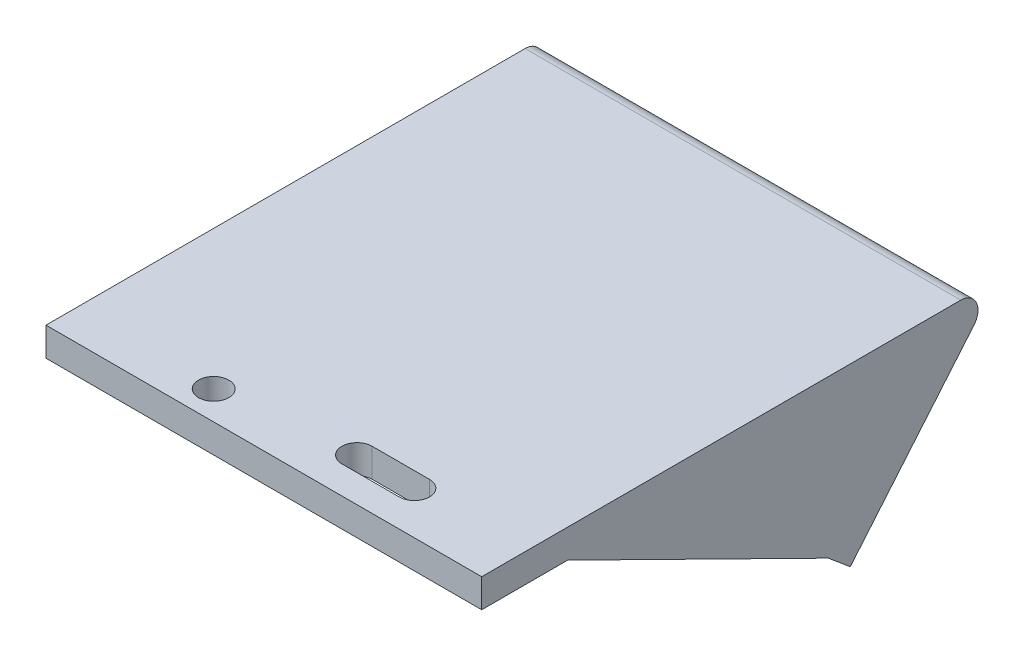
ISO-10303-21;
HEADER;
FILE_DESCRIPTION(('STEP AP214'),'2;1');
FILE_NAME('part.step','',(''),(''),'','','');
FILE_SCHEMA(('AUTOMOTIVE_DESIGN { 1 0 10303 214 1 1 1 1 }'));
ENDSEC;
DATA;
#1=APPLICATION_CONTEXT('core data for automotive mechanical design processes');
#2=APPLICATION_PROTOCOL_DEFINITION('international standard','automotive_design',2000,#1);
#3=PRODUCT_CONTEXT('',#1,'mechanical');
#4=PRODUCT('Part','Part','',(#3));
#5=PRODUCT_RELATED_PRODUCT_CATEGORY('part','',(#4));
#6=PRODUCT_DEFINITION_FORMATION('','',#4);
#7=PRODUCT_DEFINITION_CONTEXT('part definition',#1,'design');
#8=PRODUCT_DEFINITION('design','',#6,#7);
#9=PRODUCT_DEFINITION_SHAPE('','',#8);
#10=(LENGTH_UNIT() NAMED_UNIT(*) SI_UNIT(.MILLI.,.METRE.));
#11=(NAMED_UNIT(*) PLANE_ANGLE_UNIT() SI_UNIT($,.RADIAN.));
#12=(NAMED_UNIT(*) SI_UNIT($,.STERADIAN.) SOLID_ANGLE_UNIT());
#13=UNCERTAINTY_MEASURE_WITH_UNIT(LENGTH_MEASURE(1.E-05),#10,'distance_accuracy_value','');
#14=(GEOMETRIC_REPRESENTATION_CONTEXT(3) GLOBAL_UNCERTAINTY_ASSIGNED_CONTEXT((#13)) GLOBAL_UNIT_ASSIGNED_CONTEXT((#10,
#11,#12)) REPRESENTATION_CONTEXT('',''));
#15=CARTESIAN_POINT('',(0.,0.,0.));
#16=DIRECTION('',(0.,0.,1.));
#17=DIRECTION('',(1.,0.,0.));
#18=AXIS2_PLACEMENT_3D('',#15,#16,#17);
#19=CARTESIAN_POINT('',(76.,0.,0.));
#20=DIRECTION('',(0.,0.,-1.));
#21=DIRECTION('',(0.,1.,0.));
#22=AXIS2_PLACEMENT_3D('',#19,#20,#21);
#23=PLANE('',#22);
#24=DIRECTION('',(1.,0.,0.));
#25=VECTOR('',#24,1.);
#26=CARTESIAN_POINT('',(76.,0.,0.));
#27=LINE('',#26,#25);
#28=CARTESIAN_POINT('',(73.,0.,0.));
#29=VERTEX_POINT('',#28);
#30=CARTESIAN_POINT('',(149.,0.,0.));
#31=VERTEX_POINT('',#30);
#32=EDGE_CURVE('E251',#29,#31,#27,.T.);
#33=ORIENTED_EDGE('',*,*,#32,.F.);
#34=DIRECTION('',(0.,1.,0.));
#35=VECTOR('',#34,1.);
#36=CARTESIAN_POINT('',(73.,0.,0.));
#37=LINE('',#36,#35);
#38=CARTESIAN_POINT('',(73.,-5.,0.));
#39=VERTEX_POINT('',#38);
#40=EDGE_CURVE('E182',#39,#29,#37,.T.);
#41=ORIENTED_EDGE('',*,*,#40,.F.);
#42=DIRECTION('',(1.,0.,0.));
#43=VECTOR('',#42,1.);
#44=CARTESIAN_POINT('',(76.,-5.,0.));
#45=LINE('',#44,#43);
#46=CARTESIAN_POINT('',(149.,-5.,0.));
#47=VERTEX_POINT('',#46);
#48=EDGE_CURVE('E266',#39,#47,#45,.T.);
#49=ORIENTED_EDGE('',*,*,#48,.T.);
#50=DIRECTION('',(0.,1.,0.));
#51=VECTOR('',#50,1.);
#52=CARTESIAN_POINT('',(149.,0.,0.));
#53=LINE('',#52,#51);
#54=EDGE_CURVE('E207',#47,#31,#53,.T.);
#55=ORIENTED_EDGE('',*,*,#54,.T.);
#56=EDGE_LOOP('',(#33,#41,#49,#55));
#57=FACE_BOUND('',#56,.T.);
#58=ADVANCED_FACE('F39',(#57),#23,.F.);
#59=CARTESIAN_POINT('',(76.,-5.,0.));
#60=DIRECTION('',(0.,1.,0.));
#61=DIRECTION('',(0.,0.,1.));
#62=AXIS2_PLACEMENT_3D('',#59,#60,#61);
#63=PLANE('',#62);
#64=DIRECTION('',(1.,0.,0.));
#65=VECTOR('',#64,1.);
#66=CARTESIAN_POINT('',(76.,-5.,-10.15));
#67=LINE('',#66,#65);
#68=CARTESIAN_POINT('',(119.75,-5.,-10.15));
#69=VERTEX_POINT('',#68);
#70=CARTESIAN_POINT('',(129.75,-5.,-10.15));
#71=VERTEX_POINT('',#70);
#72=EDGE_CURVE('E176',#69,#71,#67,.T.);
#73=ORIENTED_EDGE('',*,*,#72,.F.);
#74=CARTESIAN_POINT('',(119.75,-5.,-7.5));
#75=DIRECTION('',(0.,-1.,0.));
#76=DIRECTION('',(0.,0.,1.));
#77=AXIS2_PLACEMENT_3D('',#74,#75,#76);
#78=CIRCLE('',#77,2.65);
#79=CARTESIAN_POINT('',(119.75,-5.,-4.85));
#80=VERTEX_POINT('',#79);
#81=EDGE_CURVE('E174',#80,#69,#78,.T.);
#82=ORIENTED_EDGE('',*,*,#81,.F.);
#83=DIRECTION('',(-1.,0.,0.));
#84=VECTOR('',#83,1.);
#85=CARTESIAN_POINT('',(76.,-5.,-4.85000000000001));
#86=LINE('',#85,#84);
#87=CARTESIAN_POINT('',(129.75,-5.,-4.85));
#88=VERTEX_POINT('',#87);
#89=EDGE_CURVE('E150',#88,#80,#86,.T.);
#90=ORIENTED_EDGE('',*,*,#89,.F.);
#91=CARTESIAN_POINT('',(129.75,-5.,-7.49999999999999));
#92=DIRECTION('',(0.,-1.,0.));
#93=DIRECTION('',(0.,0.,1.));
#94=AXIS2_PLACEMENT_3D('',#91,#92,#93);
#95=CIRCLE('',#94,2.65);
#96=EDGE_CURVE('E179',#71,#88,#95,.T.);
#97=ORIENTED_EDGE('',*,*,#96,.F.);
#98=EDGE_LOOP('',(#73,#82,#90,#97));
#99=FACE_BOUND('',#98,.T.);
#100=CARTESIAN_POINT('',(97.25,-5.,-5.));
#101=DIRECTION('',(0.,-1.,0.));
#102=DIRECTION('',(0.,0.,1.));
#103=AXIS2_PLACEMENT_3D('',#100,#101,#102);
#104=CIRCLE('',#103,2.65);
#105=CARTESIAN_POINT('',(97.25,-5.,-2.35));
#106=VERTEX_POINT('',#105);
#107=EDGE_CURVE('E234',#106,#106,#104,.T.);
#108=ORIENTED_EDGE('',*,*,#107,.F.);
#109=EDGE_LOOP('',(#108));
#110=FACE_BOUND('',#109,.T.);
#111=ORIENTED_EDGE('',*,*,#48,.F.);
#112=DIRECTION('',(0.,0.,1.));
#113=VECTOR('',#112,1.);
#114=CARTESIAN_POINT('',(73.,-5.,0.));
#115=LINE('',#114,#113);
#116=CARTESIAN_POINT('',(73.,-5.,-15.));
#117=VERTEX_POINT('',#116);
#118=EDGE_CURVE('E185',#117,#39,#115,.T.);
#119=ORIENTED_EDGE('',*,*,#118,.F.);
#120=DIRECTION('',(1.,0.,0.));
#121=VECTOR('',#120,1.);
#122=CARTESIAN_POINT('',(73.,-5.,-15.));
#123=LINE('',#122,#121);
#124=CARTESIAN_POINT('',(76.,-5.,-15.));
#125=VERTEX_POINT('',#124);
#126=EDGE_CURVE('E203',#117,#125,#123,.T.);
#127=ORIENTED_EDGE('',*,*,#126,.T.);
#128=DIRECTION('',(0.,0.,-1.));
#129=VECTOR('',#128,1.);
#130=CARTESIAN_POINT('',(76.,-5.,0.));
#131=LINE('',#130,#129);
#132=CARTESIAN_POINT('',(76.,-5.,-72.8439446359236));
#133=VERTEX_POINT('',#132);
#134=EDGE_CURVE('E244',#125,#133,#131,.T.);
#135=ORIENTED_EDGE('',*,*,#134,.T.);
#136=DIRECTION('',(1.,0.,0.));
#137=VECTOR('',#136,1.);
#138=CARTESIAN_POINT('',(76.,-5.,-72.8439446359236));
#139=LINE('',#138,#137);
#140=CARTESIAN_POINT('',(146.,-5.,-72.8439446359236));
#141=VERTEX_POINT('',#140);
#142=EDGE_CURVE('E282',#141,#133,#139,.F.);
#143=ORIENTED_EDGE('',*,*,#142,.F.);
#144=DIRECTION('',(0.,0.,-1.));
#145=VECTOR('',#144,1.);
#146=CARTESIAN_POINT('',(146.,-5.,0.));
#147=LINE('',#146,#145);
#148=CARTESIAN_POINT('',(146.,-5.,-15.));
#149=VERTEX_POINT('',#148);
#150=EDGE_CURVE('E252',#149,#141,#147,.T.);
#151=ORIENTED_EDGE('',*,*,#150,.F.);
#152=DIRECTION('',(-1.,0.,0.));
#153=VECTOR('',#152,1.);
#154=CARTESIAN_POINT('',(149.,-5.,-15.));
#155=LINE('',#154,#153);
#156=CARTESIAN_POINT('',(149.,-5.,-15.));
#157=VERTEX_POINT('',#156);
#158=EDGE_CURVE('E224',#157,#149,#155,.T.);
#159=ORIENTED_EDGE('',*,*,#158,.F.);
#160=DIRECTION('',(0.,0.,1.));
#161=VECTOR('',#160,1.);
#162=CARTESIAN_POINT('',(149.,-5.,0.));
#163=LINE('',#162,#161);
#164=EDGE_CURVE('E222',#157,#47,#163,.T.);
#165=ORIENTED_EDGE('',*,*,#164,.T.);
#166=EDGE_LOOP('',(#111,#119,#127,#135,#143,#151,#159,#165));
#167=FACE_BOUND('',#166,.T.);
#168=ADVANCED_FACE('F294',(#99,#110,#167),#63,.F.);
#169=CARTESIAN_POINT('',(76.,-27.4278396763265,-60.4582733969436));
#170=DIRECTION('',(0.,-0.642787609686538,-0.766044443118979));
#171=DIRECTION('',(0.,0.766044443118979,-0.642787609686538));
#172=AXIS2_PLACEMENT_3D('',#169,#170,#171);
#173=PLANE('',#172);
#174=CARTESIAN_POINT('',(133.5,-19.7673952451367,-66.886149493809));
#175=DIRECTION('',(0.,-0.642787609686538,-0.766044443118979));
#176=DIRECTION('',(0.,-0.766044443118979,0.642787609686538));
#177=AXIS2_PLACEMENT_3D('',#174,#175,#176);
#178=CIRCLE('',#177,1.65000000000001);
#179=CARTESIAN_POINT('',(133.5,-21.031368576283,-65.8255499378262));
#180=VERTEX_POINT('',#179);
#181=EDGE_CURVE('E238',#180,#180,#178,.T.);
#182=ORIENTED_EDGE('',*,*,#181,.T.);
#183=EDGE_LOOP('',(#182));
#184=FACE_BOUND('',#183,.T.);
#185=CARTESIAN_POINT('',(88.5,-19.7673952451367,-66.886149493809));
#186=DIRECTION('',(0.,-0.642787609686538,-0.766044443118979));
#187=DIRECTION('',(0.,-0.766044443118979,0.642787609686538));
#188=AXIS2_PLACEMENT_3D('',#185,#186,#187);
#189=CIRCLE('',#188,1.65);
#190=CARTESIAN_POINT('',(88.5,-21.031368576283,-65.8255499378262));
#191=VERTEX_POINT('',#190);
#192=EDGE_CURVE('E237',#191,#191,#189,.T.);
#193=ORIENTED_EDGE('',*,*,#192,.T.);
#194=EDGE_LOOP('',(#193));
#195=FACE_BOUND('',#194,.T.);
#196=DIRECTION('',(0.,-0.766044443118979,0.642787609686538));
#197=VECTOR('',#196,1.);
#198=CARTESIAN_POINT('',(76.,-27.4278396763265,-60.4582733969436));
#199=LINE('',#198,#197);
#200=CARTESIAN_POINT('',(76.,-9.92836282905961,-75.1420779652805));
#201=VERTEX_POINT('',#200);
#202=CARTESIAN_POINT('',(76.,-27.4278396763265,-60.4582733969436));
#203=VERTEX_POINT('',#202);
#204=EDGE_CURVE('E247',#201,#203,#199,.T.);
#205=ORIENTED_EDGE('',*,*,#204,.T.);
#206=DIRECTION('',(1.,0.,0.));
#207=VECTOR('',#206,1.);
#208=CARTESIAN_POINT('',(76.,-27.4278396763265,-60.4582733969436));
#209=LINE('',#208,#207);
#210=CARTESIAN_POINT('',(146.,-27.4278396763265,-60.4582733969436));
#211=VERTEX_POINT('',#210);
#212=EDGE_CURVE('E263',#203,#211,#209,.T.);
#213=ORIENTED_EDGE('',*,*,#212,.T.);
#214=DIRECTION('',(0.,-0.766044443118979,0.642787609686538));
#215=VECTOR('',#214,1.);
#216=CARTESIAN_POINT('',(146.,-27.4278396763265,-60.4582733969436));
#217=LINE('',#216,#215);
#218=CARTESIAN_POINT('',(146.,-9.92836282905961,-75.1420779652805));
#219=VERTEX_POINT('',#218);
#220=EDGE_CURVE('E248',#219,#211,#217,.T.);
#221=ORIENTED_EDGE('',*,*,#220,.F.);
#222=DIRECTION('',(1.,0.,0.));
#223=VECTOR('',#222,1.);
#224=CARTESIAN_POINT('',(146.,-9.92836282905961,-75.1420779652805));
#225=LINE('',#224,#223);
#226=EDGE_CURVE('E279',#201,#219,#225,.T.);
#227=ORIENTED_EDGE('',*,*,#226,.F.);
#228=EDGE_LOOP('',(#205,#213,#221,#227));
#229=FACE_BOUND('',#228,.T.);
#230=ADVANCED_FACE('F302',(#184,#195,#229),#173,.F.);
#231=CARTESIAN_POINT('',(76.,-30.6417777247592,-64.2884956125385));
#232=DIRECTION('',(0.,0.766044443118979,-0.642787609686538));
#233=DIRECTION('',(0.,0.642787609686538,0.766044443118979));
#234=AXIS2_PLACEMENT_3D('',#231,#232,#233);
#235=PLANE('',#234);
#236=ORIENTED_EDGE('',*,*,#212,.F.);
#237=DIRECTION('',(1.,0.,0.));
#238=VECTOR('',#237,1.);
#239=CARTESIAN_POINT('',(73.,-27.4278396763265,-60.4582733969436));
#240=LINE('',#239,#238);
#241=CARTESIAN_POINT('',(73.,-27.4278396763265,-60.4582733969436));
#242=VERTEX_POINT('',#241);
#243=EDGE_CURVE('E199',#242,#203,#240,.T.);
#244=ORIENTED_EDGE('',*,*,#243,.F.);
#245=DIRECTION('',(0.,0.642787609686538,0.766044443118979));
#246=VECTOR('',#245,1.);
#247=CARTESIAN_POINT('',(73.,13.6745711607901,-11.4743276175264));
#248=LINE('',#247,#246);
#249=CARTESIAN_POINT('',(73.,-30.6417777247592,-64.2884956125385));
#250=VERTEX_POINT('',#249);
#251=EDGE_CURVE('E189',#250,#242,#248,.T.);
#252=ORIENTED_EDGE('',*,*,#251,.F.);
#253=DIRECTION('',(1.,0.,0.));
#254=VECTOR('',#253,1.);
#255=CARTESIAN_POINT('',(76.,-30.6417777247592,-64.2884956125385));
#256=LINE('',#255,#254);
#257=CARTESIAN_POINT('',(149.,-30.6417777247592,-64.2884956125385));
#258=VERTEX_POINT('',#257);
#259=EDGE_CURVE('E260',#250,#258,#256,.T.);
#260=ORIENTED_EDGE('',*,*,#259,.T.);
#261=DIRECTION('',(0.,0.642787609686538,0.766044443118979));
#262=VECTOR('',#261,1.);
#263=CARTESIAN_POINT('',(149.,13.6745711607901,-11.4743276175264));
#264=LINE('',#263,#262);
#265=CARTESIAN_POINT('',(149.,-27.4278396763265,-60.4582733969436));
#266=VERTEX_POINT('',#265);
#267=EDGE_CURVE('E217',#258,#266,#264,.T.);
#268=ORIENTED_EDGE('',*,*,#267,.T.);
#269=DIRECTION('',(-1.,0.,0.));
#270=VECTOR('',#269,1.);
#271=CARTESIAN_POINT('',(149.,-27.4278396763265,-60.4582733969436));
#272=LINE('',#271,#270);
#273=EDGE_CURVE('E228',#266,#211,#272,.T.);
#274=ORIENTED_EDGE('',*,*,#273,.T.);
#275=EDGE_LOOP('',(#236,#244,#252,#260,#268,#274));
#276=FACE_BOUND('',#275,.T.);
#277=ADVANCED_FACE('F306',(#276),#235,.F.);
#278=CARTESIAN_POINT('',(76.,0.,-90.));
#279=DIRECTION('',(0.,0.642787609686538,0.76604444311898));
#280=DIRECTION('',(0.,-0.76604444311898,0.642787609686538));
#281=AXIS2_PLACEMENT_3D('',#278,#279,#280);
#282=PLANE('',#281);
#283=CARTESIAN_POINT('',(133.5,-22.9813332935694,-70.7163717094039));
#284=DIRECTION('',(0.,-0.642787609686538,-0.76604444311898));
#285=DIRECTION('',(0.,-0.76604444311898,0.642787609686538));
#286=AXIS2_PLACEMENT_3D('',#283,#284,#285);
#287=CIRCLE('',#286,1.65000000000001);
#288=CARTESIAN_POINT('',(133.5,-24.2453066247157,-69.6557721534211));
#289=VERTEX_POINT('',#288);
#290=EDGE_CURVE('E255',#289,#289,#287,.T.);
#291=ORIENTED_EDGE('',*,*,#290,.F.);
#292=EDGE_LOOP('',(#291));
#293=FACE_BOUND('',#292,.T.);
#294=CARTESIAN_POINT('',(88.5,-22.9813332935694,-70.7163717094039));
#295=DIRECTION('',(0.,-0.642787609686538,-0.76604444311898));
#296=DIRECTION('',(0.,-0.76604444311898,0.642787609686538));
#297=AXIS2_PLACEMENT_3D('',#294,#295,#296);
#298=CIRCLE('',#297,1.65);
#299=CARTESIAN_POINT('',(88.5,-24.2453066247157,-69.6557721534211));
#300=VERTEX_POINT('',#299);
#301=EDGE_CURVE('E241',#300,#300,#298,.T.);
#302=ORIENTED_EDGE('',*,*,#301,.F.);
#303=EDGE_LOOP('',(#302));
#304=FACE_BOUND('',#303,.T.);
#305=ORIENTED_EDGE('',*,*,#259,.F.);
#306=DIRECTION('',(0.,-0.766044443118979,0.642787609686538));
#307=VECTOR('',#306,1.);
#308=CARTESIAN_POINT('',(73.,-44.3163488855493,-52.8141679950121));
#309=LINE('',#308,#307);
#310=CARTESIAN_POINT('',(73.,-4.92836282905962,-85.8646125678283));
#311=VERTEX_POINT('',#310);
#312=EDGE_CURVE('E192',#311,#250,#309,.T.);
#313=ORIENTED_EDGE('',*,*,#312,.F.);
#314=DIRECTION('',(1.,0.,0.));
#315=VECTOR('',#314,1.);
#316=CARTESIAN_POINT('',(76.,-4.92836282905961,-85.8646125678283));
#317=LINE('',#316,#315);
#318=CARTESIAN_POINT('',(149.,-4.92836282905962,-85.8646125678283));
#319=VERTEX_POINT('',#318);
#320=EDGE_CURVE('E276',#319,#311,#317,.F.);
#321=ORIENTED_EDGE('',*,*,#320,.F.);
#322=DIRECTION('',(0.,-0.766044443118979,0.642787609686538));
#323=VECTOR('',#322,1.);
#324=CARTESIAN_POINT('',(149.,-44.3163488855493,-52.8141679950121));
#325=LINE('',#324,#323);
#326=EDGE_CURVE('E215',#319,#258,#325,.T.);
#327=ORIENTED_EDGE('',*,*,#326,.T.);
#328=EDGE_LOOP('',(#305,#313,#321,#327));
#329=FACE_BOUND('',#328,.T.);
#330=ADVANCED_FACE('F357',(#293,#304,#329),#282,.F.);
#331=CARTESIAN_POINT('',(76.,0.,0.));
#332=DIRECTION('',(0.,-1.,0.));
#333=DIRECTION('',(0.,0.,-1.));
#334=AXIS2_PLACEMENT_3D('',#331,#332,#333);
#335=PLANE('',#334);
#336=DIRECTION('',(-1.,0.,0.));
#337=VECTOR('',#336,1.);
#338=CARTESIAN_POINT('',(129.75,0.,-4.85));
#339=LINE('',#338,#337);
#340=CARTESIAN_POINT('',(129.75,0.,-4.85));
#341=VERTEX_POINT('',#340);
#342=CARTESIAN_POINT('',(119.75,0.,-4.85));
#343=VERTEX_POINT('',#342);
#344=EDGE_CURVE('E148',#341,#343,#339,.T.);
#345=ORIENTED_EDGE('',*,*,#344,.T.);
#346=CARTESIAN_POINT('',(119.75,0.,-7.5));
#347=DIRECTION('',(0.,-1.,0.));
#348=DIRECTION('',(0.,0.,1.));
#349=AXIS2_PLACEMENT_3D('',#346,#347,#348);
#350=CIRCLE('',#349,2.65);
#351=CARTESIAN_POINT('',(119.75,0.,-10.15));
#352=VERTEX_POINT('',#351);
#353=EDGE_CURVE('E155',#343,#352,#350,.T.);
#354=ORIENTED_EDGE('',*,*,#353,.T.);
#355=DIRECTION('',(1.,0.,0.));
#356=VECTOR('',#355,1.);
#357=CARTESIAN_POINT('',(129.75,0.,-10.15));
#358=LINE('',#357,#356);
#359=CARTESIAN_POINT('',(129.75,0.,-10.15));
#360=VERTEX_POINT('',#359);
#361=EDGE_CURVE('E160',#352,#360,#358,.T.);
#362=ORIENTED_EDGE('',*,*,#361,.T.);
#363=CARTESIAN_POINT('',(129.75,0.,-7.49999999999999));
#364=DIRECTION('',(0.,-1.,0.));
#365=DIRECTION('',(0.,0.,1.));
#366=AXIS2_PLACEMENT_3D('',#363,#364,#365);
#367=CIRCLE('',#366,2.65);
#368=EDGE_CURVE('E164',#360,#341,#367,.T.);
#369=ORIENTED_EDGE('',*,*,#368,.T.);
#370=EDGE_LOOP('',(#345,#354,#362,#369));
#371=FACE_BOUND('',#370,.T.);
#372=CARTESIAN_POINT('',(97.25,0.,-5.));
#373=DIRECTION('',(0.,-1.,0.));
#374=DIRECTION('',(0.,0.,1.));
#375=AXIS2_PLACEMENT_3D('',#372,#373,#374);
#376=CIRCLE('',#375,2.65);
#377=CARTESIAN_POINT('',(97.25,0.,-2.35));
#378=VERTEX_POINT('',#377);
#379=EDGE_CURVE('E231',#378,#378,#376,.T.);
#380=ORIENTED_EDGE('',*,*,#379,.T.);
#381=EDGE_LOOP('',(#380));
#382=FACE_BOUND('',#381,.T.);
#383=ORIENTED_EDGE('',*,*,#32,.T.);
#384=DIRECTION('',(0.,0.,-1.));
#385=VECTOR('',#384,1.);
#386=CARTESIAN_POINT('',(149.,0.,0.));
#387=LINE('',#386,#385);
#388=CARTESIAN_POINT('',(149.,0.,-83.5664792384713));
#389=VERTEX_POINT('',#388);
#390=EDGE_CURVE('E210',#31,#389,#387,.T.);
#391=ORIENTED_EDGE('',*,*,#390,.T.);
#392=DIRECTION('',(1.,0.,0.));
#393=VECTOR('',#392,1.);
#394=CARTESIAN_POINT('',(76.,0.,-83.5664792384713));
#395=LINE('',#394,#393);
#396=CARTESIAN_POINT('',(73.,0.,-83.5664792384713));
#397=VERTEX_POINT('',#396);
#398=EDGE_CURVE('E269',#397,#389,#395,.T.);
#399=ORIENTED_EDGE('',*,*,#398,.F.);
#400=DIRECTION('',(0.,0.,-1.));
#401=VECTOR('',#400,1.);
#402=CARTESIAN_POINT('',(73.,0.,0.));
#403=LINE('',#402,#401);
#404=EDGE_CURVE('E196',#29,#397,#403,.T.);
#405=ORIENTED_EDGE('',*,*,#404,.F.);
#406=EDGE_LOOP('',(#383,#391,#399,#405));
#407=FACE_BOUND('',#406,.T.);
#408=ADVANCED_FACE('F162',(#371,#382,#407),#335,.F.);
#409=CARTESIAN_POINT('',(88.5,-35.6417777247591,-85.8045018441137));
#410=DIRECTION('',(0.,0.642787609686538,0.766044443118979));
#411=DIRECTION('',(0.,-0.766044443118979,0.642787609686538));
#412=AXIS2_PLACEMENT_3D('',#409,#410,#411);
#413=CYLINDRICAL_SURFACE('',#412,1.65);
#414=ORIENTED_EDGE('',*,*,#192,.F.);
#415=EDGE_LOOP('',(#414));
#416=FACE_BOUND('',#415,.T.);
#417=ORIENTED_EDGE('',*,*,#301,.T.);
#418=EDGE_LOOP('',(#417));
#419=FACE_BOUND('',#418,.T.);
#420=ADVANCED_FACE('F351',(#416,#419),#413,.F.);
#421=CARTESIAN_POINT('',(133.5,-35.6417777247591,-85.8045018441137));
#422=DIRECTION('',(0.,0.642787609686538,0.766044443118979));
#423=DIRECTION('',(0.,-0.766044443118979,0.642787609686538));
#424=AXIS2_PLACEMENT_3D('',#421,#422,#423);
#425=CYLINDRICAL_SURFACE('',#424,1.65000000000001);
#426=ORIENTED_EDGE('',*,*,#181,.F.);
#427=EDGE_LOOP('',(#426));
#428=FACE_BOUND('',#427,.T.);
#429=ORIENTED_EDGE('',*,*,#290,.T.);
#430=EDGE_LOOP('',(#429));
#431=FACE_BOUND('',#430,.T.);
#432=ADVANCED_FACE('F344',(#428,#431),#425,.F.);
#433=CARTESIAN_POINT('',(76.,-3.,-83.5664792384713));
#434=DIRECTION('',(1.,0.,0.));
#435=DIRECTION('',(0.,0.,1.));
#436=AXIS2_PLACEMENT_3D('',#433,#434,#435);
#437=CYLINDRICAL_SURFACE('',#436,3.);
#438=ORIENTED_EDGE('',*,*,#398,.T.);
#439=CARTESIAN_POINT('',(149.,-3.,-83.5664792384713));
#440=DIRECTION('',(-1.,0.,0.));
#441=DIRECTION('',(0.,0.,1.));
#442=AXIS2_PLACEMENT_3D('',#439,#440,#441);
#443=CIRCLE('',#442,3.);
#444=EDGE_CURVE('E213',#389,#319,#443,.T.);
#445=ORIENTED_EDGE('',*,*,#444,.T.);
#446=ORIENTED_EDGE('',*,*,#320,.T.);
#447=CARTESIAN_POINT('',(73.,-3.,-83.5664792384713));
#448=DIRECTION('',(-1.,0.,0.));
#449=DIRECTION('',(0.,0.,1.));
#450=AXIS2_PLACEMENT_3D('',#447,#448,#449);
#451=CIRCLE('',#450,3.);
#452=EDGE_CURVE('E194',#397,#311,#451,.T.);
#453=ORIENTED_EDGE('',*,*,#452,.F.);
#454=EDGE_LOOP('',(#438,#445,#446,#453));
#455=FACE_BOUND('',#454,.T.);
#456=ADVANCED_FACE('F342',(#455),#437,.T.);
#457=CARTESIAN_POINT('',(76.,-8.,-72.8439446359236));
#458=DIRECTION('',(-1.,0.,0.));
#459=DIRECTION('',(0.,0.,-1.));
#460=AXIS2_PLACEMENT_3D('',#457,#458,#459);
#461=CYLINDRICAL_SURFACE('',#460,3.);
#462=CARTESIAN_POINT('',(76.,-8.,-72.8439446359236));
#463=DIRECTION('',(1.,0.,0.));
#464=DIRECTION('',(0.,0.,-1.));
#465=AXIS2_PLACEMENT_3D('',#462,#463,#464);
#466=CIRCLE('',#465,3.);
#467=EDGE_CURVE('E11',#133,#201,#466,.F.);
#468=ORIENTED_EDGE('',*,*,#467,.T.);
#469=ORIENTED_EDGE('',*,*,#226,.T.);
#470=CARTESIAN_POINT('',(146.,-8.,-72.8439446359236));
#471=DIRECTION('',(1.,0.,0.));
#472=DIRECTION('',(0.,0.,-1.));
#473=AXIS2_PLACEMENT_3D('',#470,#471,#472);
#474=CIRCLE('',#473,3.);
#475=EDGE_CURVE('E47',#219,#141,#474,.T.);
#476=ORIENTED_EDGE('',*,*,#475,.T.);
#477=ORIENTED_EDGE('',*,*,#142,.T.);
#478=EDGE_LOOP('',(#468,#469,#476,#477));
#479=FACE_BOUND('',#478,.T.);
#480=ADVANCED_FACE('F41',(#479),#461,.F.);
#481=CARTESIAN_POINT('',(97.25,-30.6417777247592,-5.));
#482=DIRECTION('',(0.,1.,0.));
#483=DIRECTION('',(0.,0.,1.));
#484=AXIS2_PLACEMENT_3D('',#481,#482,#483);
#485=CYLINDRICAL_SURFACE('',#484,2.65);
#486=ORIENTED_EDGE('',*,*,#379,.F.);
#487=EDGE_LOOP('',(#486));
#488=FACE_BOUND('',#487,.T.);
#489=ORIENTED_EDGE('',*,*,#107,.T.);
#490=EDGE_LOOP('',(#489));
#491=FACE_BOUND('',#490,.T.);
#492=ADVANCED_FACE('F350',(#488,#491),#485,.F.);
#493=CARTESIAN_POINT('',(149.,1.93063323428507,-0.952520397645471));
#494=DIRECTION('',(0.,0.896792122766235,-0.442452131359348));
#495=DIRECTION('',(0.,0.442452131359348,0.896792122766235));
#496=AXIS2_PLACEMENT_3D('',#493,#494,#495);
#497=PLANE('',#496);
#498=DIRECTION('',(0.,0.442452131359348,0.896792122766235));
#499=VECTOR('',#498,1.);
#500=CARTESIAN_POINT('',(146.,1.93063323428507,-0.952520397645471));
#501=LINE('',#500,#499);
#502=EDGE_CURVE('E206',#211,#149,#501,.T.);
#503=ORIENTED_EDGE('',*,*,#502,.F.);
#504=ORIENTED_EDGE('',*,*,#273,.F.);
#505=DIRECTION('',(0.,0.442452131359348,0.896792122766235));
#506=VECTOR('',#505,1.);
#507=CARTESIAN_POINT('',(149.,1.93063323428507,-0.952520397645471));
#508=LINE('',#507,#506);
#509=EDGE_CURVE('E220',#266,#157,#508,.T.);
#510=ORIENTED_EDGE('',*,*,#509,.T.);
#511=ORIENTED_EDGE('',*,*,#158,.T.);
#512=EDGE_LOOP('',(#503,#504,#510,#511));
#513=FACE_BOUND('',#512,.T.);
#514=ADVANCED_FACE('F311',(#513),#497,.F.);
#515=CARTESIAN_POINT('',(149.,0.,0.));
#516=DIRECTION('',(1.,0.,0.));
#517=DIRECTION('',(0.,0.,1.));
#518=AXIS2_PLACEMENT_3D('',#515,#516,#517);
#519=PLANE('',#518);
#520=ORIENTED_EDGE('',*,*,#54,.F.);
#521=ORIENTED_EDGE('',*,*,#164,.F.);
#522=ORIENTED_EDGE('',*,*,#509,.F.);
#523=ORIENTED_EDGE('',*,*,#267,.F.);
#524=ORIENTED_EDGE('',*,*,#326,.F.);
#525=ORIENTED_EDGE('',*,*,#444,.F.);
#526=ORIENTED_EDGE('',*,*,#390,.F.);
#527=EDGE_LOOP('',(#520,#521,#522,#523,#524,#525,#526));
#528=FACE_BOUND('',#527,.T.);
#529=ADVANCED_FACE('F316',(#528),#519,.T.);
#530=CARTESIAN_POINT('',(146.,0.,0.));
#531=DIRECTION('',(1.,0.,0.));
#532=DIRECTION('',(0.,0.,1.));
#533=AXIS2_PLACEMENT_3D('',#530,#531,#532);
#534=PLANE('',#533);
#535=ORIENTED_EDGE('',*,*,#220,.T.);
#536=ORIENTED_EDGE('',*,*,#502,.T.);
#537=ORIENTED_EDGE('',*,*,#150,.T.);
#538=ORIENTED_EDGE('',*,*,#475,.F.);
#539=EDGE_LOOP('',(#535,#536,#537,#538));
#540=FACE_BOUND('',#539,.T.);
#541=ADVANCED_FACE('F290',(#540),#534,.F.);
#542=CARTESIAN_POINT('',(76.,0.,0.));
#543=DIRECTION('',(-1.,0.,0.));
#544=DIRECTION('',(0.,0.,1.));
#545=AXIS2_PLACEMENT_3D('',#542,#543,#544);
#546=PLANE('',#545);
#547=DIRECTION('',(0.,0.442452131359348,0.896792122766235));
#548=VECTOR('',#547,1.);
#549=CARTESIAN_POINT('',(76.,1.93063323428507,-0.952520397645471));
#550=LINE('',#549,#548);
#551=EDGE_CURVE('E181',#203,#125,#550,.T.);
#552=ORIENTED_EDGE('',*,*,#551,.F.);
#553=ORIENTED_EDGE('',*,*,#204,.F.);
#554=ORIENTED_EDGE('',*,*,#467,.F.);
#555=ORIENTED_EDGE('',*,*,#134,.F.);
#556=EDGE_LOOP('',(#552,#553,#554,#555));
#557=FACE_BOUND('',#556,.T.);
#558=ADVANCED_FACE('F299',(#557),#546,.F.);
#559=CARTESIAN_POINT('',(73.,1.93063323428507,-0.952520397645471));
#560=DIRECTION('',(0.,-0.896792122766235,0.442452131359348));
#561=DIRECTION('',(0.,-0.442452131359348,-0.896792122766235));
#562=AXIS2_PLACEMENT_3D('',#559,#560,#561);
#563=PLANE('',#562);
#564=ORIENTED_EDGE('',*,*,#551,.T.);
#565=ORIENTED_EDGE('',*,*,#126,.F.);
#566=DIRECTION('',(0.,0.442452131359348,0.896792122766235));
#567=VECTOR('',#566,1.);
#568=CARTESIAN_POINT('',(73.,1.93063323428507,-0.952520397645471));
#569=LINE('',#568,#567);
#570=EDGE_CURVE('E187',#242,#117,#569,.T.);
#571=ORIENTED_EDGE('',*,*,#570,.F.);
#572=ORIENTED_EDGE('',*,*,#243,.T.);
#573=EDGE_LOOP('',(#564,#565,#571,#572));
#574=FACE_BOUND('',#573,.T.);
#575=ADVANCED_FACE('F323',(#574),#563,.T.);
#576=CARTESIAN_POINT('',(73.,0.,0.));
#577=DIRECTION('',(-1.,0.,0.));
#578=DIRECTION('',(0.,0.,1.));
#579=AXIS2_PLACEMENT_3D('',#576,#577,#578);
#580=PLANE('',#579);
#581=ORIENTED_EDGE('',*,*,#40,.T.);
#582=ORIENTED_EDGE('',*,*,#404,.T.);
#583=ORIENTED_EDGE('',*,*,#452,.T.);
#584=ORIENTED_EDGE('',*,*,#312,.T.);
#585=ORIENTED_EDGE('',*,*,#251,.T.);
#586=ORIENTED_EDGE('',*,*,#570,.T.);
#587=ORIENTED_EDGE('',*,*,#118,.T.);
#588=EDGE_LOOP('',(#581,#582,#583,#584,#585,#586,#587));
#589=FACE_BOUND('',#588,.T.);
#590=ADVANCED_FACE('F320',(#589),#580,.T.);
#591=CARTESIAN_POINT('',(129.75,-30.6417777247592,-7.49999999999999));
#592=DIRECTION('',(0.,1.,0.));
#593=DIRECTION('',(0.,0.,1.));
#594=AXIS2_PLACEMENT_3D('',#591,#592,#593);
#595=CYLINDRICAL_SURFACE('',#594,2.65);
#596=DIRECTION('',(0.,1.,0.));
#597=VECTOR('',#596,1.);
#598=CARTESIAN_POINT('',(129.75,-30.6417777247592,-10.15));
#599=LINE('',#598,#597);
#600=EDGE_CURVE('E169',#71,#360,#599,.T.);
#601=ORIENTED_EDGE('',*,*,#600,.F.);
#602=ORIENTED_EDGE('',*,*,#96,.T.);
#603=DIRECTION('',(0.,1.,0.));
#604=VECTOR('',#603,1.);
#605=CARTESIAN_POINT('',(129.75,-30.6417777247592,-4.85));
#606=LINE('',#605,#604);
#607=EDGE_CURVE('E62',#88,#341,#606,.T.);
#608=ORIENTED_EDGE('',*,*,#607,.T.);
#609=ORIENTED_EDGE('',*,*,#368,.F.);
#610=EDGE_LOOP('',(#601,#602,#608,#609));
#611=FACE_BOUND('',#610,.T.);
#612=ADVANCED_FACE('F330',(#611),#595,.F.);
#613=CARTESIAN_POINT('',(129.75,-30.6417777247592,-10.15));
#614=DIRECTION('',(0.,0.,-1.));
#615=DIRECTION('',(1.,0.,0.));
#616=AXIS2_PLACEMENT_3D('',#613,#614,#615);
#617=PLANE('',#616);
#618=DIRECTION('',(0.,1.,0.));
#619=VECTOR('',#618,1.);
#620=CARTESIAN_POINT('',(119.75,-30.6417777247592,-10.15));
#621=LINE('',#620,#619);
#622=EDGE_CURVE('E152',#69,#352,#621,.T.);
#623=ORIENTED_EDGE('',*,*,#622,.F.);
#624=ORIENTED_EDGE('',*,*,#72,.T.);
#625=ORIENTED_EDGE('',*,*,#600,.T.);
#626=ORIENTED_EDGE('',*,*,#361,.F.);
#627=EDGE_LOOP('',(#623,#624,#625,#626));
#628=FACE_BOUND('',#627,.T.);
#629=ADVANCED_FACE('F487',(#628),#617,.F.);
#630=CARTESIAN_POINT('',(119.75,-30.6417777247592,-7.5));
#631=DIRECTION('',(0.,1.,0.));
#632=DIRECTION('',(0.,0.,1.));
#633=AXIS2_PLACEMENT_3D('',#630,#631,#632);
#634=CYLINDRICAL_SURFACE('',#633,2.65);
#635=DIRECTION('',(0.,1.,0.));
#636=VECTOR('',#635,1.);
#637=CARTESIAN_POINT('',(119.75,-30.6417777247592,-4.85));
#638=LINE('',#637,#636);
#639=EDGE_CURVE('E54',#80,#343,#638,.T.);
#640=ORIENTED_EDGE('',*,*,#639,.F.);
#641=ORIENTED_EDGE('',*,*,#81,.T.);
#642=ORIENTED_EDGE('',*,*,#622,.T.);
#643=ORIENTED_EDGE('',*,*,#353,.F.);
#644=EDGE_LOOP('',(#640,#641,#642,#643));
#645=FACE_BOUND('',#644,.T.);
#646=ADVANCED_FACE('F156',(#645),#634,.F.);
#647=CARTESIAN_POINT('',(129.75,-30.6417777247592,-4.85));
#648=DIRECTION('',(0.,0.,1.));
#649=DIRECTION('',(-1.,0.,0.));
#650=AXIS2_PLACEMENT_3D('',#647,#648,#649);
#651=PLANE('',#650);
#652=ORIENTED_EDGE('',*,*,#607,.F.);
#653=ORIENTED_EDGE('',*,*,#89,.T.);
#654=ORIENTED_EDGE('',*,*,#639,.T.);
#655=ORIENTED_EDGE('',*,*,#344,.F.);
#656=EDGE_LOOP('',(#652,#653,#654,#655));
#657=FACE_BOUND('',#656,.T.);
#658=ADVANCED_FACE('F146',(#657),#651,.F.);
#659=CLOSED_SHELL('',(#58,#168,#230,#277,#330,#408,#420,#432,#456,#480,#492,#514,#529,#541,#558,
#575,#590,#612,#629,#646,#658));
#660=MANIFOLD_SOLID_BREP('B2',#659);
#661=ADVANCED_BREP_SHAPE_REPRESENTATION('',(#18,#660),#14);
#662=SHAPE_DEFINITION_REPRESENTATION(#9,#661);
ENDSEC;
END-ISO-10303-21;
